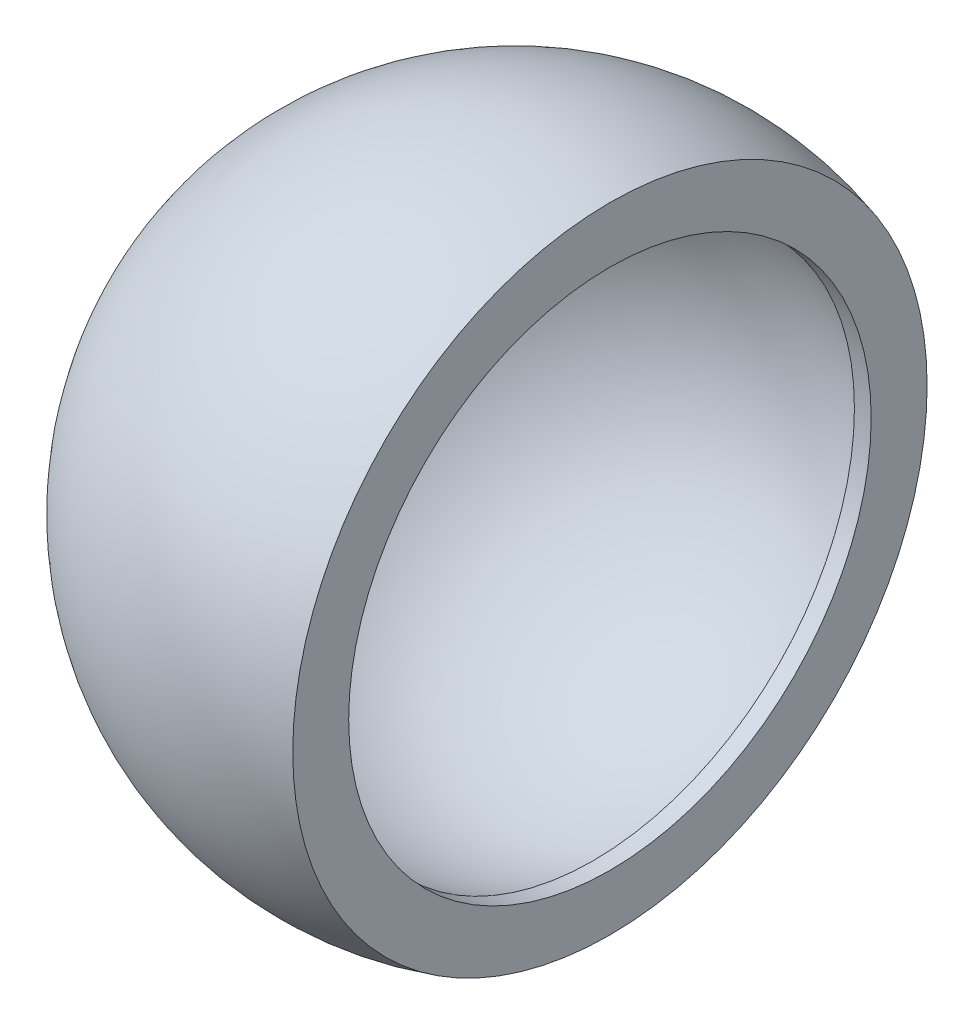
ISO-10303-21;
HEADER;
FILE_DESCRIPTION(('STEP AP214'),'2;1');
FILE_NAME('part.step','',(''),(''),'','','');
FILE_SCHEMA(('AUTOMOTIVE_DESIGN { 1 0 10303 214 1 1 1 1 }'));
ENDSEC;
DATA;
#1=APPLICATION_CONTEXT('core data for automotive mechanical design processes');
#2=APPLICATION_PROTOCOL_DEFINITION('international standard','automotive_design',2000,#1);
#3=PRODUCT_CONTEXT('',#1,'mechanical');
#4=PRODUCT('Part','Part','',(#3));
#5=PRODUCT_RELATED_PRODUCT_CATEGORY('part','',(#4));
#6=PRODUCT_DEFINITION_FORMATION('','',#4);
#7=PRODUCT_DEFINITION_CONTEXT('part definition',#1,'design');
#8=PRODUCT_DEFINITION('design','',#6,#7);
#9=PRODUCT_DEFINITION_SHAPE('','',#8);
#10=(LENGTH_UNIT() NAMED_UNIT(*) SI_UNIT(.MILLI.,.METRE.));
#11=(NAMED_UNIT(*) PLANE_ANGLE_UNIT() SI_UNIT($,.RADIAN.));
#12=(NAMED_UNIT(*) SI_UNIT($,.STERADIAN.) SOLID_ANGLE_UNIT());
#13=UNCERTAINTY_MEASURE_WITH_UNIT(LENGTH_MEASURE(1.E-05),#10,'distance_accuracy_value','');
#14=(GEOMETRIC_REPRESENTATION_CONTEXT(3) GLOBAL_UNCERTAINTY_ASSIGNED_CONTEXT((#13)) GLOBAL_UNIT_ASSIGNED_CONTEXT((#10,
#11,#12)) REPRESENTATION_CONTEXT('',''));
#15=CARTESIAN_POINT('',(0.,0.,0.));
#16=DIRECTION('',(0.,0.,1.));
#17=DIRECTION('',(1.,0.,0.));
#18=AXIS2_PLACEMENT_3D('',#15,#16,#17);
#19=CARTESIAN_POINT('',(-10.,0.,0.));
#20=DIRECTION('',(1.,0.,0.));
#21=DIRECTION('',(0.,0.,-1.));
#22=AXIS2_PLACEMENT_3D('',#19,#20,#21);
#23=CYLINDRICAL_SURFACE('',#22,9.57972369621136);
#24=CARTESIAN_POINT('',(3.48278351783399,0.,0.));
#25=DIRECTION('',(1.,0.,0.));
#26=DIRECTION('',(0.,0.,-1.));
#27=AXIS2_PLACEMENT_3D('',#24,#25,#26);
#28=CIRCLE('',#27,9.57972369621136);
#29=CARTESIAN_POINT('',(3.48278351783399,0.,-9.57972369621136));
#30=VERTEX_POINT('',#29);
#31=EDGE_CURVE('E10',#30,#30,#28,.T.);
#32=ORIENTED_EDGE('',*,*,#31,.T.);
#33=EDGE_LOOP('',(#32));
#34=FACE_BOUND('',#33,.T.);
#35=CARTESIAN_POINT('',(2.86860487070745,0.,0.));
#36=DIRECTION('',(1.,0.,0.));
#37=DIRECTION('',(0.,0.,-1.));
#38=AXIS2_PLACEMENT_3D('',#35,#36,#37);
#39=CIRCLE('',#38,9.57972369621136);
#40=CARTESIAN_POINT('',(2.86860487070745,0.,-9.57972369621136));
#41=VERTEX_POINT('',#40);
#42=EDGE_CURVE('E41',#41,#41,#39,.T.);
#43=ORIENTED_EDGE('',*,*,#42,.F.);
#44=EDGE_LOOP('',(#43));
#45=FACE_BOUND('',#44,.T.);
#46=ADVANCED_FACE('F31',(#34,#45),#23,.F.);
#47=CARTESIAN_POINT('',(3.48278351783399,0.,-11.630777084451));
#48=DIRECTION('',(1.,0.,0.));
#49=DIRECTION('',(0.,0.,-1.));
#50=AXIS2_PLACEMENT_3D('',#47,#48,#49);
#51=PLANE('',#50);
#52=CARTESIAN_POINT('',(3.48278351783399,0.,0.));
#53=DIRECTION('',(1.,0.,0.));
#54=DIRECTION('',(0.,0.,-1.));
#55=AXIS2_PLACEMENT_3D('',#52,#53,#54);
#56=CIRCLE('',#55,11.630777084451);
#57=CARTESIAN_POINT('',(3.48278351783399,0.,-11.630777084451));
#58=VERTEX_POINT('',#57);
#59=EDGE_CURVE('E37',#58,#58,#56,.T.);
#60=ORIENTED_EDGE('',*,*,#59,.T.);
#61=EDGE_LOOP('',(#60));
#62=FACE_BOUND('',#61,.T.);
#63=ORIENTED_EDGE('',*,*,#31,.F.);
#64=EDGE_LOOP('',(#63));
#65=FACE_BOUND('',#64,.T.);
#66=ADVANCED_FACE('F51',(#62,#65),#51,.T.);
#67=CARTESIAN_POINT('',(0.,0.,0.));
#68=DIRECTION('',(1.,0.,0.));
#69=DIRECTION('',(0.,0.,-1.));
#70=AXIS2_PLACEMENT_3D('',#67,#68,#69);
#71=SPHERICAL_SURFACE('',#70,12.1410360604145);
#72=ORIENTED_EDGE('',*,*,#59,.F.);
#73=EDGE_LOOP('',(#72));
#74=FACE_BOUND('',#73,.T.);
#75=ADVANCED_FACE('F55',(#74),#71,.T.);
#76=CARTESIAN_POINT('',(0.,0.,0.));
#77=DIRECTION('',(1.,0.,0.));
#78=DIRECTION('',(0.,0.,-1.));
#79=AXIS2_PLACEMENT_3D('',#76,#77,#78);
#80=SPHERICAL_SURFACE('',#79,10.);
#81=ORIENTED_EDGE('',*,*,#42,.T.);
#82=EDGE_LOOP('',(#81));
#83=FACE_BOUND('',#82,.T.);
#84=ADVANCED_FACE('F48',(#83),#80,.F.);
#85=CLOSED_SHELL('',(#46,#66,#75,#84));
#86=MANIFOLD_SOLID_BREP('B2',#85);
#87=ADVANCED_BREP_SHAPE_REPRESENTATION('',(#18,#86),#14);
#88=SHAPE_DEFINITION_REPRESENTATION(#9,#87);
ENDSEC;
END-ISO-10303-21;
